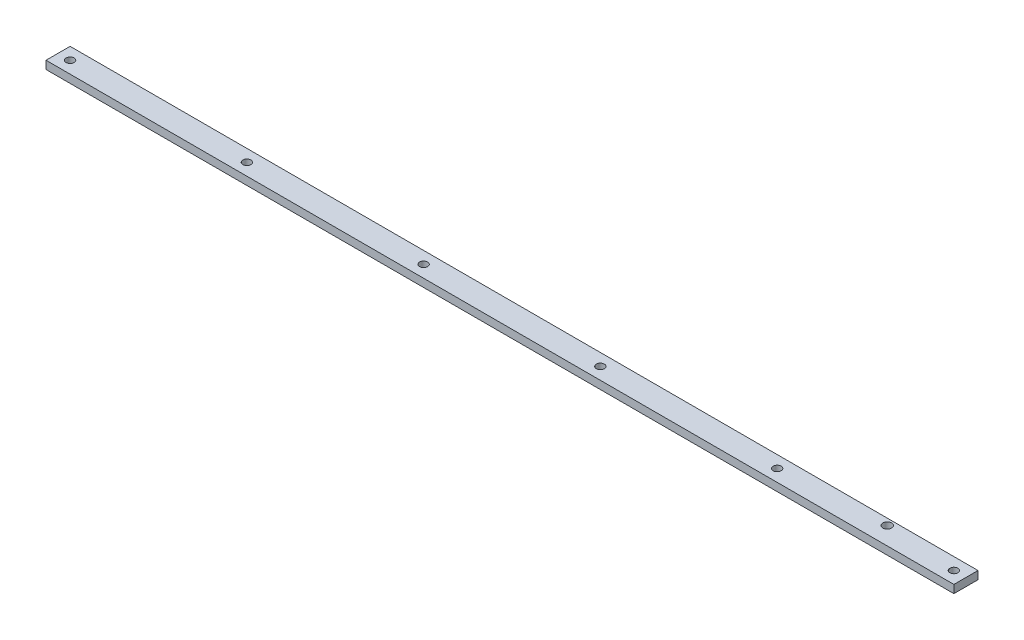
ISO-10303-21;
HEADER;
FILE_DESCRIPTION(('STEP AP214'),'2;1');
FILE_NAME('part.step','',(''),(''),'','','');
FILE_SCHEMA(('AUTOMOTIVE_DESIGN { 1 0 10303 214 1 1 1 1 }'));
ENDSEC;
DATA;
#1=APPLICATION_CONTEXT('core data for automotive mechanical design processes');
#2=APPLICATION_PROTOCOL_DEFINITION('international standard','automotive_design',2000,#1);
#3=PRODUCT_CONTEXT('',#1,'mechanical');
#4=PRODUCT('Part','Part','',(#3));
#5=PRODUCT_RELATED_PRODUCT_CATEGORY('part','',(#4));
#6=PRODUCT_DEFINITION_FORMATION('','',#4);
#7=PRODUCT_DEFINITION_CONTEXT('part definition',#1,'design');
#8=PRODUCT_DEFINITION('design','',#6,#7);
#9=PRODUCT_DEFINITION_SHAPE('','',#8);
#10=(LENGTH_UNIT() NAMED_UNIT(*) SI_UNIT(.MILLI.,.METRE.));
#11=(NAMED_UNIT(*) PLANE_ANGLE_UNIT() SI_UNIT($,.RADIAN.));
#12=(NAMED_UNIT(*) SI_UNIT($,.STERADIAN.) SOLID_ANGLE_UNIT());
#13=UNCERTAINTY_MEASURE_WITH_UNIT(LENGTH_MEASURE(1.E-05),#10,'distance_accuracy_value','');
#14=(GEOMETRIC_REPRESENTATION_CONTEXT(3) GLOBAL_UNCERTAINTY_ASSIGNED_CONTEXT((#13)) GLOBAL_UNIT_ASSIGNED_CONTEXT((#10,
#11,#12)) REPRESENTATION_CONTEXT('',''));
#15=CARTESIAN_POINT('',(0.,0.,0.));
#16=DIRECTION('',(0.,0.,1.));
#17=DIRECTION('',(1.,0.,0.));
#18=AXIS2_PLACEMENT_3D('',#15,#16,#17);
#19=CARTESIAN_POINT('',(552.916934757431,5.,-15.));
#20=DIRECTION('',(0.,0.,1.));
#21=DIRECTION('',(1.,0.,0.));
#22=AXIS2_PLACEMENT_3D('',#19,#20,#21);
#23=PLANE('',#22);
#24=DIRECTION('',(0.,1.,0.));
#25=VECTOR('',#24,1.);
#26=CARTESIAN_POINT('',(-577.083065242569,5.,-15.));
#27=LINE('',#26,#25);
#28=CARTESIAN_POINT('',(-577.083065242569,-5.,-15.));
#29=VERTEX_POINT('',#28);
#30=CARTESIAN_POINT('',(-577.083065242569,5.,-15.));
#31=VERTEX_POINT('',#30);
#32=EDGE_CURVE('E105',#29,#31,#27,.T.);
#33=ORIENTED_EDGE('',*,*,#32,.T.);
#34=DIRECTION('',(-1.,0.,0.));
#35=VECTOR('',#34,1.);
#36=CARTESIAN_POINT('',(552.916934757431,5.,-15.));
#37=LINE('',#36,#35);
#38=CARTESIAN_POINT('',(552.916934757431,5.,-15.));
#39=VERTEX_POINT('',#38);
#40=EDGE_CURVE('E96',#39,#31,#37,.T.);
#41=ORIENTED_EDGE('',*,*,#40,.F.);
#42=DIRECTION('',(0.,1.,0.));
#43=VECTOR('',#42,1.);
#44=CARTESIAN_POINT('',(552.916934757431,5.,-15.));
#45=LINE('',#44,#43);
#46=CARTESIAN_POINT('',(552.916934757431,-5.,-15.));
#47=VERTEX_POINT('',#46);
#48=EDGE_CURVE('E89',#47,#39,#45,.T.);
#49=ORIENTED_EDGE('',*,*,#48,.F.);
#50=DIRECTION('',(-1.,0.,0.));
#51=VECTOR('',#50,1.);
#52=CARTESIAN_POINT('',(552.916934757431,-5.,-15.));
#53=LINE('',#52,#51);
#54=EDGE_CURVE('E101',#47,#29,#53,.T.);
#55=ORIENTED_EDGE('',*,*,#54,.T.);
#56=EDGE_LOOP('',(#33,#41,#49,#55));
#57=FACE_BOUND('',#56,.T.);
#58=ADVANCED_FACE('F36',(#57),#23,.F.);
#59=CARTESIAN_POINT('',(552.916934757431,5.,-15.));
#60=DIRECTION('',(0.,-1.,0.));
#61=DIRECTION('',(0.,0.,-1.));
#62=AXIS2_PLACEMENT_3D('',#59,#60,#61);
#63=PLANE('',#62);
#64=CARTESIAN_POINT('',(447.916934757432,5.,-7.));
#65=DIRECTION('',(0.,1.,0.));
#66=DIRECTION('',(0.,0.,1.));
#67=AXIS2_PLACEMENT_3D('',#64,#65,#66);
#68=CIRCLE('',#67,5.50000000000002);
#69=CARTESIAN_POINT('',(447.916934757432,5.,-1.49999999999998));
#70=VERTEX_POINT('',#69);
#71=EDGE_CURVE('E196',#70,#70,#68,.T.);
#72=ORIENTED_EDGE('',*,*,#71,.F.);
#73=EDGE_LOOP('',(#72));
#74=FACE_BOUND('',#73,.T.);
#75=CARTESIAN_POINT('',(-122.083065242568,5.,0.));
#76=DIRECTION('',(0.,1.,0.));
#77=DIRECTION('',(0.,0.,1.));
#78=AXIS2_PLACEMENT_3D('',#75,#76,#77);
#79=CIRCLE('',#78,5.);
#80=CARTESIAN_POINT('',(-122.083065242568,5.,5.));
#81=VERTEX_POINT('',#80);
#82=EDGE_CURVE('E203',#81,#81,#79,.T.);
#83=ORIENTED_EDGE('',*,*,#82,.F.);
#84=EDGE_LOOP('',(#83));
#85=FACE_BOUND('',#84,.T.);
#86=CARTESIAN_POINT('',(-342.083065242568,5.,0.));
#87=DIRECTION('',(0.,1.,0.));
#88=DIRECTION('',(0.,0.,1.));
#89=AXIS2_PLACEMENT_3D('',#86,#87,#88);
#90=CIRCLE('',#89,5.);
#91=CARTESIAN_POINT('',(-342.083065242568,5.,5.));
#92=VERTEX_POINT('',#91);
#93=EDGE_CURVE('E206',#92,#92,#90,.T.);
#94=ORIENTED_EDGE('',*,*,#93,.F.);
#95=EDGE_LOOP('',(#94));
#96=FACE_BOUND('',#95,.T.);
#97=CARTESIAN_POINT('',(-562.083065242568,5.,0.));
#98=DIRECTION('',(0.,1.,0.));
#99=DIRECTION('',(0.,0.,1.));
#100=AXIS2_PLACEMENT_3D('',#97,#98,#99);
#101=CIRCLE('',#100,5.);
#102=CARTESIAN_POINT('',(-562.083065242568,5.,5.));
#103=VERTEX_POINT('',#102);
#104=EDGE_CURVE('E212',#103,#103,#101,.T.);
#105=ORIENTED_EDGE('',*,*,#104,.F.);
#106=EDGE_LOOP('',(#105));
#107=FACE_BOUND('',#106,.T.);
#108=DIRECTION('',(0.,0.,1.));
#109=VECTOR('',#108,1.);
#110=CARTESIAN_POINT('',(-577.083065242569,5.,-15.));
#111=LINE('',#110,#109);
#112=CARTESIAN_POINT('',(-577.083065242569,5.,15.));
#113=VERTEX_POINT('',#112);
#114=EDGE_CURVE('E95',#31,#113,#111,.T.);
#115=ORIENTED_EDGE('',*,*,#114,.T.);
#116=DIRECTION('',(-1.,0.,0.));
#117=VECTOR('',#116,1.);
#118=CARTESIAN_POINT('',(552.916934757431,5.,15.));
#119=LINE('',#118,#117);
#120=CARTESIAN_POINT('',(552.916934757431,5.,15.));
#121=VERTEX_POINT('',#120);
#122=EDGE_CURVE('E92',#121,#113,#119,.T.);
#123=ORIENTED_EDGE('',*,*,#122,.F.);
#124=DIRECTION('',(0.,0.,1.));
#125=VECTOR('',#124,1.);
#126=CARTESIAN_POINT('',(552.916934757431,5.,-15.));
#127=LINE('',#126,#125);
#128=EDGE_CURVE('E84',#39,#121,#127,.T.);
#129=ORIENTED_EDGE('',*,*,#128,.F.);
#130=ORIENTED_EDGE('',*,*,#40,.T.);
#131=EDGE_LOOP('',(#115,#123,#129,#130));
#132=FACE_BOUND('',#131,.T.);
#133=CARTESIAN_POINT('',(97.9169347574315,5.,0.));
#134=DIRECTION('',(0.,1.,0.));
#135=DIRECTION('',(0.,0.,1.));
#136=AXIS2_PLACEMENT_3D('',#133,#134,#135);
#137=CIRCLE('',#136,5.);
#138=CARTESIAN_POINT('',(97.9169347574315,5.,5.));
#139=VERTEX_POINT('',#138);
#140=EDGE_CURVE('E118',#139,#139,#137,.T.);
#141=ORIENTED_EDGE('',*,*,#140,.F.);
#142=EDGE_LOOP('',(#141));
#143=FACE_BOUND('',#142,.T.);
#144=CARTESIAN_POINT('',(317.916934757432,5.,0.));
#145=DIRECTION('',(0.,1.,0.));
#146=DIRECTION('',(0.,0.,1.));
#147=AXIS2_PLACEMENT_3D('',#144,#145,#146);
#148=CIRCLE('',#147,5.);
#149=CARTESIAN_POINT('',(317.916934757432,5.,5.));
#150=VERTEX_POINT('',#149);
#151=EDGE_CURVE('E124',#150,#150,#148,.T.);
#152=ORIENTED_EDGE('',*,*,#151,.F.);
#153=EDGE_LOOP('',(#152));
#154=FACE_BOUND('',#153,.T.);
#155=CARTESIAN_POINT('',(537.916934757431,5.,0.));
#156=DIRECTION('',(0.,1.,0.));
#157=DIRECTION('',(0.,0.,1.));
#158=AXIS2_PLACEMENT_3D('',#155,#156,#157);
#159=CIRCLE('',#158,5.);
#160=CARTESIAN_POINT('',(537.916934757431,5.,5.));
#161=VERTEX_POINT('',#160);
#162=EDGE_CURVE('E11',#161,#161,#159,.T.);
#163=ORIENTED_EDGE('',*,*,#162,.F.);
#164=EDGE_LOOP('',(#163));
#165=FACE_BOUND('',#164,.T.);
#166=ADVANCED_FACE('F93',(#74,#85,#96,#107,#132,#143,#154,#165),#63,.F.);
#167=CARTESIAN_POINT('',(552.916934757431,-5.,15.));
#168=DIRECTION('',(0.,0.,-1.));
#169=DIRECTION('',(-1.,0.,0.));
#170=AXIS2_PLACEMENT_3D('',#167,#168,#169);
#171=PLANE('',#170);
#172=DIRECTION('',(0.,-1.,0.));
#173=VECTOR('',#172,1.);
#174=CARTESIAN_POINT('',(-577.083065242569,-5.,15.));
#175=LINE('',#174,#173);
#176=CARTESIAN_POINT('',(-577.083065242569,-5.,15.));
#177=VERTEX_POINT('',#176);
#178=EDGE_CURVE('E70',#113,#177,#175,.T.);
#179=ORIENTED_EDGE('',*,*,#178,.T.);
#180=DIRECTION('',(-1.,0.,0.));
#181=VECTOR('',#180,1.);
#182=CARTESIAN_POINT('',(552.916934757431,-5.,15.));
#183=LINE('',#182,#181);
#184=CARTESIAN_POINT('',(552.916934757431,-5.,15.));
#185=VERTEX_POINT('',#184);
#186=EDGE_CURVE('E97',#185,#177,#183,.T.);
#187=ORIENTED_EDGE('',*,*,#186,.F.);
#188=DIRECTION('',(0.,-1.,0.));
#189=VECTOR('',#188,1.);
#190=CARTESIAN_POINT('',(552.916934757431,-5.,15.));
#191=LINE('',#190,#189);
#192=EDGE_CURVE('E87',#121,#185,#191,.T.);
#193=ORIENTED_EDGE('',*,*,#192,.F.);
#194=ORIENTED_EDGE('',*,*,#122,.T.);
#195=EDGE_LOOP('',(#179,#187,#193,#194));
#196=FACE_BOUND('',#195,.T.);
#197=ADVANCED_FACE('F99',(#196),#171,.F.);
#198=CARTESIAN_POINT('',(552.916934757431,-5.,-15.));
#199=DIRECTION('',(0.,1.,0.));
#200=DIRECTION('',(0.,0.,1.));
#201=AXIS2_PLACEMENT_3D('',#198,#199,#200);
#202=PLANE('',#201);
#203=CARTESIAN_POINT('',(447.916934757432,-5.,-7.));
#204=DIRECTION('',(0.,1.,0.));
#205=DIRECTION('',(0.,0.,1.));
#206=AXIS2_PLACEMENT_3D('',#203,#204,#205);
#207=CIRCLE('',#206,5.50000000000002);
#208=CARTESIAN_POINT('',(447.916934757432,-5.,-1.49999999999998));
#209=VERTEX_POINT('',#208);
#210=EDGE_CURVE('E194',#209,#209,#207,.T.);
#211=ORIENTED_EDGE('',*,*,#210,.T.);
#212=EDGE_LOOP('',(#211));
#213=FACE_BOUND('',#212,.T.);
#214=CARTESIAN_POINT('',(-122.083065242568,-5.,0.));
#215=DIRECTION('',(0.,1.,0.));
#216=DIRECTION('',(0.,0.,1.));
#217=AXIS2_PLACEMENT_3D('',#214,#215,#216);
#218=CIRCLE('',#217,5.);
#219=CARTESIAN_POINT('',(-122.083065242568,-5.,5.));
#220=VERTEX_POINT('',#219);
#221=EDGE_CURVE('E198',#220,#220,#218,.T.);
#222=ORIENTED_EDGE('',*,*,#221,.T.);
#223=EDGE_LOOP('',(#222));
#224=FACE_BOUND('',#223,.T.);
#225=CARTESIAN_POINT('',(-342.083065242568,-5.,0.));
#226=DIRECTION('',(0.,1.,0.));
#227=DIRECTION('',(0.,0.,1.));
#228=AXIS2_PLACEMENT_3D('',#225,#226,#227);
#229=CIRCLE('',#228,5.);
#230=CARTESIAN_POINT('',(-342.083065242568,-5.,5.));
#231=VERTEX_POINT('',#230);
#232=EDGE_CURVE('E209',#231,#231,#229,.T.);
#233=ORIENTED_EDGE('',*,*,#232,.T.);
#234=EDGE_LOOP('',(#233));
#235=FACE_BOUND('',#234,.T.);
#236=CARTESIAN_POINT('',(-562.083065242568,-5.,0.));
#237=DIRECTION('',(0.,1.,0.));
#238=DIRECTION('',(0.,0.,1.));
#239=AXIS2_PLACEMENT_3D('',#236,#237,#238);
#240=CIRCLE('',#239,5.);
#241=CARTESIAN_POINT('',(-562.083065242568,-5.,5.));
#242=VERTEX_POINT('',#241);
#243=EDGE_CURVE('E108',#242,#242,#240,.T.);
#244=ORIENTED_EDGE('',*,*,#243,.T.);
#245=EDGE_LOOP('',(#244));
#246=FACE_BOUND('',#245,.T.);
#247=DIRECTION('',(0.,0.,-1.));
#248=VECTOR('',#247,1.);
#249=CARTESIAN_POINT('',(-577.083065242569,-5.,-15.));
#250=LINE('',#249,#248);
#251=EDGE_CURVE('E76',#177,#29,#250,.T.);
#252=ORIENTED_EDGE('',*,*,#251,.T.);
#253=ORIENTED_EDGE('',*,*,#54,.F.);
#254=DIRECTION('',(0.,0.,-1.));
#255=VECTOR('',#254,1.);
#256=CARTESIAN_POINT('',(552.916934757431,-5.,-15.));
#257=LINE('',#256,#255);
#258=EDGE_CURVE('E53',#185,#47,#257,.T.);
#259=ORIENTED_EDGE('',*,*,#258,.F.);
#260=ORIENTED_EDGE('',*,*,#186,.T.);
#261=EDGE_LOOP('',(#252,#253,#259,#260));
#262=FACE_BOUND('',#261,.T.);
#263=CARTESIAN_POINT('',(97.9169347574315,-5.,0.));
#264=DIRECTION('',(0.,1.,0.));
#265=DIRECTION('',(0.,0.,1.));
#266=AXIS2_PLACEMENT_3D('',#263,#264,#265);
#267=CIRCLE('',#266,5.);
#268=CARTESIAN_POINT('',(97.9169347574315,-5.,5.));
#269=VERTEX_POINT('',#268);
#270=EDGE_CURVE('E115',#269,#269,#267,.T.);
#271=ORIENTED_EDGE('',*,*,#270,.T.);
#272=EDGE_LOOP('',(#271));
#273=FACE_BOUND('',#272,.T.);
#274=CARTESIAN_POINT('',(317.916934757432,-5.,0.));
#275=DIRECTION('',(0.,1.,0.));
#276=DIRECTION('',(0.,0.,1.));
#277=AXIS2_PLACEMENT_3D('',#274,#275,#276);
#278=CIRCLE('',#277,5.);
#279=CARTESIAN_POINT('',(317.916934757432,-5.,5.));
#280=VERTEX_POINT('',#279);
#281=EDGE_CURVE('E121',#280,#280,#278,.T.);
#282=ORIENTED_EDGE('',*,*,#281,.T.);
#283=EDGE_LOOP('',(#282));
#284=FACE_BOUND('',#283,.T.);
#285=CARTESIAN_POINT('',(537.916934757431,-5.,0.));
#286=DIRECTION('',(0.,1.,0.));
#287=DIRECTION('',(0.,0.,1.));
#288=AXIS2_PLACEMENT_3D('',#285,#286,#287);
#289=CIRCLE('',#288,5.);
#290=CARTESIAN_POINT('',(537.916934757431,-5.,5.));
#291=VERTEX_POINT('',#290);
#292=EDGE_CURVE('E45',#291,#291,#289,.T.);
#293=ORIENTED_EDGE('',*,*,#292,.T.);
#294=EDGE_LOOP('',(#293));
#295=FACE_BOUND('',#294,.T.);
#296=ADVANCED_FACE('F129',(#213,#224,#235,#246,#262,#273,#284,#295),#202,.F.);
#297=CARTESIAN_POINT('',(552.916934757431,0.,0.));
#298=DIRECTION('',(-1.,0.,0.));
#299=DIRECTION('',(0.,0.,1.));
#300=AXIS2_PLACEMENT_3D('',#297,#298,#299);
#301=PLANE('',#300);
#302=ORIENTED_EDGE('',*,*,#48,.T.);
#303=ORIENTED_EDGE('',*,*,#128,.T.);
#304=ORIENTED_EDGE('',*,*,#192,.T.);
#305=ORIENTED_EDGE('',*,*,#258,.T.);
#306=EDGE_LOOP('',(#302,#303,#304,#305));
#307=FACE_BOUND('',#306,.T.);
#308=ADVANCED_FACE('F85',(#307),#301,.F.);
#309=CARTESIAN_POINT('',(-577.083065242569,0.,0.));
#310=DIRECTION('',(-1.,0.,0.));
#311=DIRECTION('',(0.,0.,1.));
#312=AXIS2_PLACEMENT_3D('',#309,#310,#311);
#313=PLANE('',#312);
#314=ORIENTED_EDGE('',*,*,#32,.F.);
#315=ORIENTED_EDGE('',*,*,#251,.F.);
#316=ORIENTED_EDGE('',*,*,#178,.F.);
#317=ORIENTED_EDGE('',*,*,#114,.F.);
#318=EDGE_LOOP('',(#314,#315,#316,#317));
#319=FACE_BOUND('',#318,.T.);
#320=ADVANCED_FACE('F169',(#319),#313,.T.);
#321=CARTESIAN_POINT('',(-562.083065242568,5.,0.));
#322=DIRECTION('',(0.,1.,0.));
#323=DIRECTION('',(0.,0.,1.));
#324=AXIS2_PLACEMENT_3D('',#321,#322,#323);
#325=CYLINDRICAL_SURFACE('',#324,5.);
#326=ORIENTED_EDGE('',*,*,#243,.F.);
#327=EDGE_LOOP('',(#326));
#328=FACE_BOUND('',#327,.T.);
#329=ORIENTED_EDGE('',*,*,#104,.T.);
#330=EDGE_LOOP('',(#329));
#331=FACE_BOUND('',#330,.T.);
#332=ADVANCED_FACE('F175',(#328,#331),#325,.F.);
#333=CARTESIAN_POINT('',(-342.083065242568,5.,0.));
#334=DIRECTION('',(0.,1.,0.));
#335=DIRECTION('',(0.,0.,1.));
#336=AXIS2_PLACEMENT_3D('',#333,#334,#335);
#337=CYLINDRICAL_SURFACE('',#336,5.);
#338=ORIENTED_EDGE('',*,*,#232,.F.);
#339=EDGE_LOOP('',(#338));
#340=FACE_BOUND('',#339,.T.);
#341=ORIENTED_EDGE('',*,*,#93,.T.);
#342=EDGE_LOOP('',(#341));
#343=FACE_BOUND('',#342,.T.);
#344=ADVANCED_FACE('F180',(#340,#343),#337,.F.);
#345=CARTESIAN_POINT('',(-122.083065242568,5.,0.));
#346=DIRECTION('',(0.,1.,0.));
#347=DIRECTION('',(0.,0.,1.));
#348=AXIS2_PLACEMENT_3D('',#345,#346,#347);
#349=CYLINDRICAL_SURFACE('',#348,5.);
#350=ORIENTED_EDGE('',*,*,#221,.F.);
#351=EDGE_LOOP('',(#350));
#352=FACE_BOUND('',#351,.T.);
#353=ORIENTED_EDGE('',*,*,#82,.T.);
#354=EDGE_LOOP('',(#353));
#355=FACE_BOUND('',#354,.T.);
#356=ADVANCED_FACE('F153',(#352,#355),#349,.F.);
#357=CARTESIAN_POINT('',(97.9169347574315,5.,0.));
#358=DIRECTION('',(0.,1.,0.));
#359=DIRECTION('',(0.,0.,1.));
#360=AXIS2_PLACEMENT_3D('',#357,#358,#359);
#361=CYLINDRICAL_SURFACE('',#360,5.);
#362=ORIENTED_EDGE('',*,*,#270,.F.);
#363=EDGE_LOOP('',(#362));
#364=FACE_BOUND('',#363,.T.);
#365=ORIENTED_EDGE('',*,*,#140,.T.);
#366=EDGE_LOOP('',(#365));
#367=FACE_BOUND('',#366,.T.);
#368=ADVANCED_FACE('F151',(#364,#367),#361,.F.);
#369=CARTESIAN_POINT('',(317.916934757432,5.,0.));
#370=DIRECTION('',(0.,1.,0.));
#371=DIRECTION('',(0.,0.,1.));
#372=AXIS2_PLACEMENT_3D('',#369,#370,#371);
#373=CYLINDRICAL_SURFACE('',#372,5.);
#374=ORIENTED_EDGE('',*,*,#281,.F.);
#375=EDGE_LOOP('',(#374));
#376=FACE_BOUND('',#375,.T.);
#377=ORIENTED_EDGE('',*,*,#151,.T.);
#378=EDGE_LOOP('',(#377));
#379=FACE_BOUND('',#378,.T.);
#380=ADVANCED_FACE('F134',(#376,#379),#373,.F.);
#381=CARTESIAN_POINT('',(537.916934757431,5.,0.));
#382=DIRECTION('',(0.,1.,0.));
#383=DIRECTION('',(0.,0.,1.));
#384=AXIS2_PLACEMENT_3D('',#381,#382,#383);
#385=CYLINDRICAL_SURFACE('',#384,5.);
#386=ORIENTED_EDGE('',*,*,#292,.F.);
#387=EDGE_LOOP('',(#386));
#388=FACE_BOUND('',#387,.T.);
#389=ORIENTED_EDGE('',*,*,#162,.T.);
#390=EDGE_LOOP('',(#389));
#391=FACE_BOUND('',#390,.T.);
#392=ADVANCED_FACE('F38',(#388,#391),#385,.F.);
#393=CARTESIAN_POINT('',(447.916934757432,-5.,-7.));
#394=DIRECTION('',(0.,1.,0.));
#395=DIRECTION('',(0.,0.,1.));
#396=AXIS2_PLACEMENT_3D('',#393,#394,#395);
#397=CYLINDRICAL_SURFACE('',#396,5.50000000000002);
#398=ORIENTED_EDGE('',*,*,#210,.F.);
#399=EDGE_LOOP('',(#398));
#400=FACE_BOUND('',#399,.T.);
#401=ORIENTED_EDGE('',*,*,#71,.T.);
#402=EDGE_LOOP('',(#401));
#403=FACE_BOUND('',#402,.T.);
#404=ADVANCED_FACE('F133',(#400,#403),#397,.F.);
#405=CLOSED_SHELL('',(#58,#166,#197,#296,#308,#320,#332,#344,#356,#368,#380,#392,#404));
#406=MANIFOLD_SOLID_BREP('B2',#405);
#407=ADVANCED_BREP_SHAPE_REPRESENTATION('',(#18,#406),#14);
#408=SHAPE_DEFINITION_REPRESENTATION(#9,#407);
ENDSEC;
END-ISO-10303-21;
